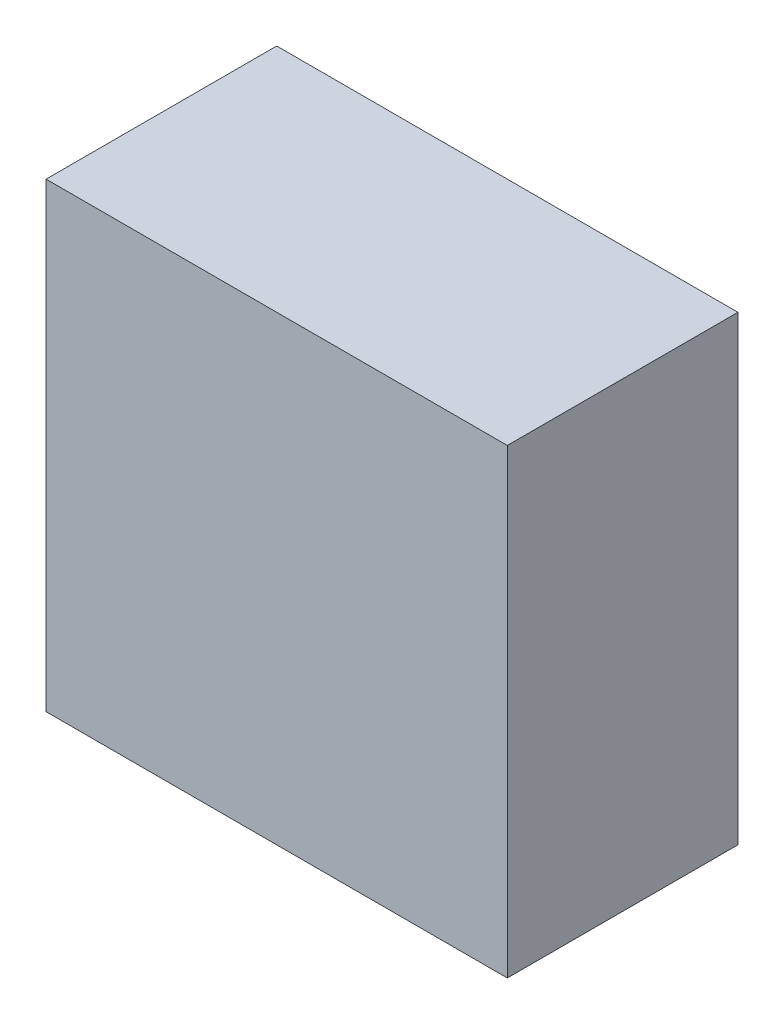
ISO-10303-21;
HEADER;
FILE_DESCRIPTION(('STEP AP214'),'2;1');
FILE_NAME('part.step','',(''),(''),'','','');
FILE_SCHEMA(('AUTOMOTIVE_DESIGN { 1 0 10303 214 1 1 1 1 }'));
ENDSEC;
DATA;
#1=APPLICATION_CONTEXT('core data for automotive mechanical design processes');
#2=APPLICATION_PROTOCOL_DEFINITION('international standard','automotive_design',2000,#1);
#3=PRODUCT_CONTEXT('',#1,'mechanical');
#4=PRODUCT('Part','Part','',(#3));
#5=PRODUCT_RELATED_PRODUCT_CATEGORY('part','',(#4));
#6=PRODUCT_DEFINITION_FORMATION('','',#4);
#7=PRODUCT_DEFINITION_CONTEXT('part definition',#1,'design');
#8=PRODUCT_DEFINITION('design','',#6,#7);
#9=PRODUCT_DEFINITION_SHAPE('','',#8);
#10=(LENGTH_UNIT() NAMED_UNIT(*) SI_UNIT(.MILLI.,.METRE.));
#11=(NAMED_UNIT(*) PLANE_ANGLE_UNIT() SI_UNIT($,.RADIAN.));
#12=(NAMED_UNIT(*) SI_UNIT($,.STERADIAN.) SOLID_ANGLE_UNIT());
#13=UNCERTAINTY_MEASURE_WITH_UNIT(LENGTH_MEASURE(1.E-05),#10,'distance_accuracy_value','');
#14=(GEOMETRIC_REPRESENTATION_CONTEXT(3) GLOBAL_UNCERTAINTY_ASSIGNED_CONTEXT((#13)) GLOBAL_UNIT_ASSIGNED_CONTEXT((#10,
#11,#12)) REPRESENTATION_CONTEXT('',''));
#15=CARTESIAN_POINT('',(0.,0.,0.));
#16=DIRECTION('',(0.,0.,1.));
#17=DIRECTION('',(1.,0.,0.));
#18=AXIS2_PLACEMENT_3D('',#15,#16,#17);
#19=CARTESIAN_POINT('',(0.,0.,2.75));
#20=DIRECTION('',(0.,0.,-1.));
#21=DIRECTION('',(-1.,0.,0.));
#22=AXIS2_PLACEMENT_3D('',#19,#20,#21);
#23=PLANE('',#22);
#24=DIRECTION('',(1.,0.,0.));
#25=VECTOR('',#24,1.);
#26=CARTESIAN_POINT('',(-58.,165.941489418563,2.75));
#27=LINE('',#26,#25);
#28=CARTESIAN_POINT('',(-62.,165.941489418563,2.75));
#29=VERTEX_POINT('',#28);
#30=CARTESIAN_POINT('',(-58.,165.941489418563,2.75));
#31=VERTEX_POINT('',#30);
#32=EDGE_CURVE('E80',#29,#31,#27,.T.);
#33=ORIENTED_EDGE('',*,*,#32,.T.);
#34=DIRECTION('',(0.,1.,0.));
#35=VECTOR('',#34,1.);
#36=CARTESIAN_POINT('',(-58.,169.941489418563,2.75));
#37=LINE('',#36,#35);
#38=CARTESIAN_POINT('',(-58.,169.941489418563,2.75));
#39=VERTEX_POINT('',#38);
#40=EDGE_CURVE('E55',#31,#39,#37,.T.);
#41=ORIENTED_EDGE('',*,*,#40,.T.);
#42=DIRECTION('',(1.,0.,0.));
#43=VECTOR('',#42,1.);
#44=CARTESIAN_POINT('',(-58.,169.941489418563,2.75));
#45=LINE('',#44,#43);
#46=CARTESIAN_POINT('',(-62.,169.941489418563,2.75));
#47=VERTEX_POINT('',#46);
#48=EDGE_CURVE('E57',#39,#47,#45,.F.);
#49=ORIENTED_EDGE('',*,*,#48,.T.);
#50=DIRECTION('',(0.,1.,0.));
#51=VECTOR('',#50,1.);
#52=CARTESIAN_POINT('',(-62.,169.941489418563,2.75));
#53=LINE('',#52,#51);
#54=EDGE_CURVE('E20',#47,#29,#53,.F.);
#55=ORIENTED_EDGE('',*,*,#54,.T.);
#56=EDGE_LOOP('',(#33,#41,#49,#55));
#57=FACE_BOUND('',#56,.T.);
#58=ADVANCED_FACE('F17',(#57),#23,.F.);
#59=CARTESIAN_POINT('',(-62.,169.941489418563,2.75));
#60=DIRECTION('',(1.,0.,0.));
#61=DIRECTION('',(0.,0.,-1.));
#62=AXIS2_PLACEMENT_3D('',#59,#60,#61);
#63=PLANE('',#62);
#64=DIRECTION('',(0.,0.,1.));
#65=VECTOR('',#64,1.);
#66=CARTESIAN_POINT('',(-62.,165.941489418563,2.75));
#67=LINE('',#66,#65);
#68=CARTESIAN_POINT('',(-62.,165.941489418563,0.75));
#69=VERTEX_POINT('',#68);
#70=EDGE_CURVE('E68',#69,#29,#67,.T.);
#71=ORIENTED_EDGE('',*,*,#70,.T.);
#72=ORIENTED_EDGE('',*,*,#54,.F.);
#73=DIRECTION('',(0.,0.,-1.));
#74=VECTOR('',#73,1.);
#75=CARTESIAN_POINT('',(-62.,169.941489418563,2.75));
#76=LINE('',#75,#74);
#77=CARTESIAN_POINT('',(-62.,169.941489418563,0.75));
#78=VERTEX_POINT('',#77);
#79=EDGE_CURVE('E63',#47,#78,#76,.T.);
#80=ORIENTED_EDGE('',*,*,#79,.T.);
#81=DIRECTION('',(0.,1.,0.));
#82=VECTOR('',#81,1.);
#83=CARTESIAN_POINT('',(-62.,0.,0.75));
#84=LINE('',#83,#82);
#85=EDGE_CURVE('E83',#69,#78,#84,.T.);
#86=ORIENTED_EDGE('',*,*,#85,.F.);
#87=EDGE_LOOP('',(#71,#72,#80,#86));
#88=FACE_BOUND('',#87,.T.);
#89=ADVANCED_FACE('F65',(#88),#63,.F.);
#90=CARTESIAN_POINT('',(-58.,169.941489418563,2.75));
#91=DIRECTION('',(0.,-1.,0.));
#92=DIRECTION('',(0.,0.,-1.));
#93=AXIS2_PLACEMENT_3D('',#90,#91,#92);
#94=PLANE('',#93);
#95=ORIENTED_EDGE('',*,*,#79,.F.);
#96=ORIENTED_EDGE('',*,*,#48,.F.);
#97=DIRECTION('',(0.,0.,1.));
#98=VECTOR('',#97,1.);
#99=CARTESIAN_POINT('',(-58.,169.941489418563,2.75));
#100=LINE('',#99,#98);
#101=CARTESIAN_POINT('',(-58.,169.941489418563,0.75));
#102=VERTEX_POINT('',#101);
#103=EDGE_CURVE('E75',#39,#102,#100,.F.);
#104=ORIENTED_EDGE('',*,*,#103,.T.);
#105=DIRECTION('',(-1.,0.,0.));
#106=VECTOR('',#105,1.);
#107=CARTESIAN_POINT('',(0.,169.941489418563,0.75));
#108=LINE('',#107,#106);
#109=EDGE_CURVE('E72',#78,#102,#108,.F.);
#110=ORIENTED_EDGE('',*,*,#109,.F.);
#111=EDGE_LOOP('',(#95,#96,#104,#110));
#112=FACE_BOUND('',#111,.T.);
#113=ADVANCED_FACE('F70',(#112),#94,.F.);
#114=CARTESIAN_POINT('',(-58.,169.941489418563,2.75));
#115=DIRECTION('',(-1.,0.,0.));
#116=DIRECTION('',(0.,0.,1.));
#117=AXIS2_PLACEMENT_3D('',#114,#115,#116);
#118=PLANE('',#117);
#119=ORIENTED_EDGE('',*,*,#103,.F.);
#120=ORIENTED_EDGE('',*,*,#40,.F.);
#121=DIRECTION('',(0.,0.,1.));
#122=VECTOR('',#121,1.);
#123=CARTESIAN_POINT('',(-58.,165.941489418563,2.75));
#124=LINE('',#123,#122);
#125=CARTESIAN_POINT('',(-58.,165.941489418563,0.75));
#126=VERTEX_POINT('',#125);
#127=EDGE_CURVE('E35',#31,#126,#124,.F.);
#128=ORIENTED_EDGE('',*,*,#127,.T.);
#129=DIRECTION('',(0.,1.,0.));
#130=VECTOR('',#129,1.);
#131=CARTESIAN_POINT('',(-58.,0.,0.75));
#132=LINE('',#131,#130);
#133=EDGE_CURVE('E26',#102,#126,#132,.F.);
#134=ORIENTED_EDGE('',*,*,#133,.F.);
#135=EDGE_LOOP('',(#119,#120,#128,#134));
#136=FACE_BOUND('',#135,.T.);
#137=ADVANCED_FACE('F89',(#136),#118,.F.);
#138=CARTESIAN_POINT('',(-58.,165.941489418563,2.75));
#139=DIRECTION('',(0.,1.,0.));
#140=DIRECTION('',(0.,0.,1.));
#141=AXIS2_PLACEMENT_3D('',#138,#139,#140);
#142=PLANE('',#141);
#143=ORIENTED_EDGE('',*,*,#127,.F.);
#144=ORIENTED_EDGE('',*,*,#32,.F.);
#145=ORIENTED_EDGE('',*,*,#70,.F.);
#146=DIRECTION('',(-1.,0.,0.));
#147=VECTOR('',#146,1.);
#148=CARTESIAN_POINT('',(0.,165.941489418563,0.75));
#149=LINE('',#148,#147);
#150=EDGE_CURVE('E11',#126,#69,#149,.T.);
#151=ORIENTED_EDGE('',*,*,#150,.F.);
#152=EDGE_LOOP('',(#143,#144,#145,#151));
#153=FACE_BOUND('',#152,.T.);
#154=ADVANCED_FACE('F91',(#153),#142,.F.);
#155=CARTESIAN_POINT('',(0.,0.,0.75));
#156=DIRECTION('',(0.,0.,-1.));
#157=DIRECTION('',(-1.,0.,0.));
#158=AXIS2_PLACEMENT_3D('',#155,#156,#157);
#159=PLANE('',#158);
#160=ORIENTED_EDGE('',*,*,#133,.T.);
#161=ORIENTED_EDGE('',*,*,#150,.T.);
#162=ORIENTED_EDGE('',*,*,#85,.T.);
#163=ORIENTED_EDGE('',*,*,#109,.T.);
#164=EDGE_LOOP('',(#160,#161,#162,#163));
#165=FACE_BOUND('',#164,.T.);
#166=ADVANCED_FACE('F88',(#165),#159,.T.);
#167=CLOSED_SHELL('',(#58,#89,#113,#137,#154,#166));
#168=MANIFOLD_SOLID_BREP('B1',#167);
#169=ADVANCED_BREP_SHAPE_REPRESENTATION('',(#18,#168),#14);
#170=SHAPE_DEFINITION_REPRESENTATION(#9,#169);
ENDSEC;
END-ISO-10303-21;
